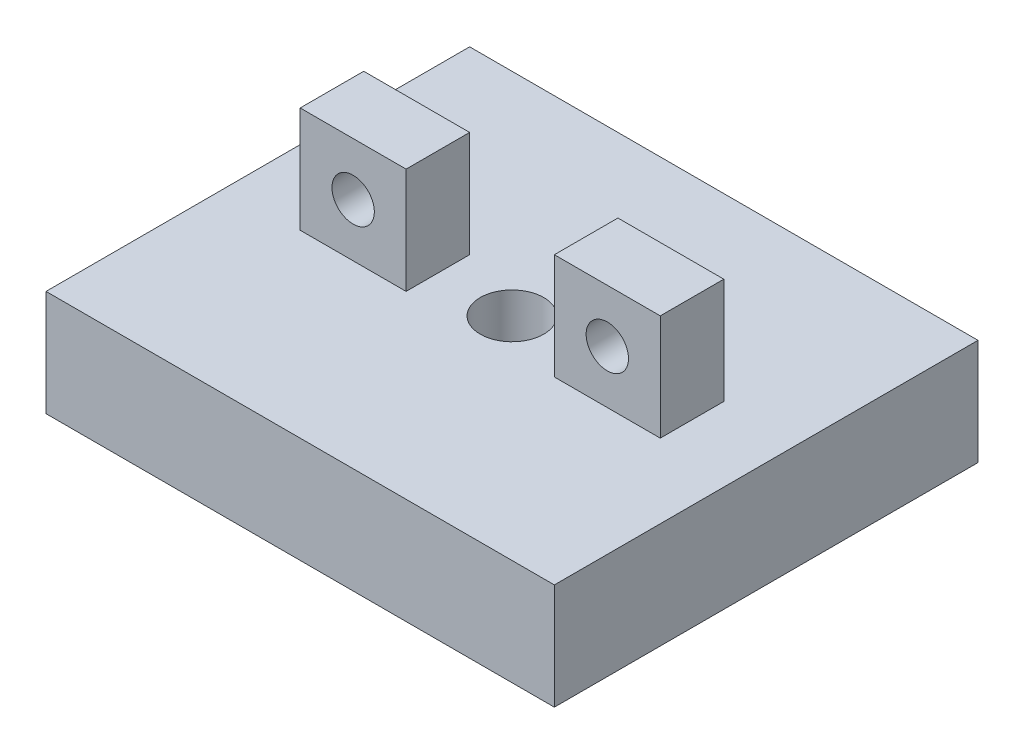
ISO-10303-21;
HEADER;
FILE_DESCRIPTION(('STEP AP214'),'2;1');
FILE_NAME('part.step','',(''),(''),'','','');
FILE_SCHEMA(('AUTOMOTIVE_DESIGN { 1 0 10303 214 1 1 1 1 }'));
ENDSEC;
DATA;
#1=APPLICATION_CONTEXT('core data for automotive mechanical design processes');
#2=APPLICATION_PROTOCOL_DEFINITION('international standard','automotive_design',2000,#1);
#3=PRODUCT_CONTEXT('',#1,'mechanical');
#4=PRODUCT('Part','Part','',(#3));
#5=PRODUCT_RELATED_PRODUCT_CATEGORY('part','',(#4));
#6=PRODUCT_DEFINITION_FORMATION('','',#4);
#7=PRODUCT_DEFINITION_CONTEXT('part definition',#1,'design');
#8=PRODUCT_DEFINITION('design','',#6,#7);
#9=PRODUCT_DEFINITION_SHAPE('','',#8);
#10=(LENGTH_UNIT() NAMED_UNIT(*) SI_UNIT(.MILLI.,.METRE.));
#11=(NAMED_UNIT(*) PLANE_ANGLE_UNIT() SI_UNIT($,.RADIAN.));
#12=(NAMED_UNIT(*) SI_UNIT($,.STERADIAN.) SOLID_ANGLE_UNIT());
#13=UNCERTAINTY_MEASURE_WITH_UNIT(LENGTH_MEASURE(1.E-05),#10,'distance_accuracy_value','');
#14=(GEOMETRIC_REPRESENTATION_CONTEXT(3) GLOBAL_UNCERTAINTY_ASSIGNED_CONTEXT((#13)) GLOBAL_UNIT_ASSIGNED_CONTEXT((#10,
#11,#12)) REPRESENTATION_CONTEXT('',''));
#15=CARTESIAN_POINT('',(0.,0.,0.));
#16=DIRECTION('',(0.,0.,1.));
#17=DIRECTION('',(1.,0.,0.));
#18=AXIS2_PLACEMENT_3D('',#15,#16,#17);
#19=CARTESIAN_POINT('',(-30.7716518723192,5.,-8.56649632267039));
#20=DIRECTION('',(1.,0.,0.));
#21=DIRECTION('',(0.,0.,-1.));
#22=AXIS2_PLACEMENT_3D('',#19,#20,#21);
#23=PLANE('',#22);
#24=DIRECTION('',(0.,0.,1.));
#25=VECTOR('',#24,1.);
#26=CARTESIAN_POINT('',(-30.7716518723192,0.,-8.56649632267039));
#27=LINE('',#26,#25);
#28=CARTESIAN_POINT('',(-30.7716518723192,0.,-8.56649632267039));
#29=VERTEX_POINT('',#28);
#30=CARTESIAN_POINT('',(-30.7716518723192,0.,11.4335036773296));
#31=VERTEX_POINT('',#30);
#32=EDGE_CURVE('E177',#29,#31,#27,.T.);
#33=ORIENTED_EDGE('',*,*,#32,.T.);
#34=DIRECTION('',(0.,-1.,0.));
#35=VECTOR('',#34,1.);
#36=CARTESIAN_POINT('',(-30.7716518723192,5.,11.4335036773296));
#37=LINE('',#36,#35);
#38=CARTESIAN_POINT('',(-30.7716518723192,5.,11.4335036773296));
#39=VERTEX_POINT('',#38);
#40=EDGE_CURVE('E11',#39,#31,#37,.T.);
#41=ORIENTED_EDGE('',*,*,#40,.F.);
#42=DIRECTION('',(0.,0.,1.));
#43=VECTOR('',#42,1.);
#44=CARTESIAN_POINT('',(-30.7716518723192,5.,-8.56649632267039));
#45=LINE('',#44,#43);
#46=CARTESIAN_POINT('',(-30.7716518723192,5.,-8.56649632267039));
#47=VERTEX_POINT('',#46);
#48=EDGE_CURVE('E186',#47,#39,#45,.T.);
#49=ORIENTED_EDGE('',*,*,#48,.F.);
#50=DIRECTION('',(0.,-1.,0.));
#51=VECTOR('',#50,1.);
#52=CARTESIAN_POINT('',(-30.7716518723192,5.,-8.56649632267039));
#53=LINE('',#52,#51);
#54=EDGE_CURVE('E196',#47,#29,#53,.T.);
#55=ORIENTED_EDGE('',*,*,#54,.T.);
#56=EDGE_LOOP('',(#33,#41,#49,#55));
#57=FACE_BOUND('',#56,.T.);
#58=ADVANCED_FACE('F37',(#57),#23,.F.);
#59=CARTESIAN_POINT('',(-30.7716518723192,5.,11.4335036773296));
#60=DIRECTION('',(0.,0.,-1.));
#61=DIRECTION('',(-1.,0.,0.));
#62=AXIS2_PLACEMENT_3D('',#59,#60,#61);
#63=PLANE('',#62);
#64=DIRECTION('',(1.,0.,0.));
#65=VECTOR('',#64,1.);
#66=CARTESIAN_POINT('',(-30.7716518723192,0.,11.4335036773296));
#67=LINE('',#66,#65);
#68=CARTESIAN_POINT('',(-6.77165187231917,0.,11.4335036773296));
#69=VERTEX_POINT('',#68);
#70=EDGE_CURVE('E199',#31,#69,#67,.T.);
#71=ORIENTED_EDGE('',*,*,#70,.T.);
#72=DIRECTION('',(0.,-1.,0.));
#73=VECTOR('',#72,1.);
#74=CARTESIAN_POINT('',(-6.77165187231917,5.,11.4335036773296));
#75=LINE('',#74,#73);
#76=CARTESIAN_POINT('',(-6.77165187231917,5.,11.4335036773296));
#77=VERTEX_POINT('',#76);
#78=EDGE_CURVE('E44',#77,#69,#75,.T.);
#79=ORIENTED_EDGE('',*,*,#78,.F.);
#80=DIRECTION('',(1.,0.,0.));
#81=VECTOR('',#80,1.);
#82=CARTESIAN_POINT('',(-30.7716518723192,5.,11.4335036773296));
#83=LINE('',#82,#81);
#84=EDGE_CURVE('E189',#39,#77,#83,.T.);
#85=ORIENTED_EDGE('',*,*,#84,.F.);
#86=ORIENTED_EDGE('',*,*,#40,.T.);
#87=EDGE_LOOP('',(#71,#79,#85,#86));
#88=FACE_BOUND('',#87,.T.);
#89=ADVANCED_FACE('F228',(#88),#63,.F.);
#90=CARTESIAN_POINT('',(-6.77165187231918,5.,-8.56649632267039));
#91=DIRECTION('',(-1.,0.,0.));
#92=DIRECTION('',(0.,0.,1.));
#93=AXIS2_PLACEMENT_3D('',#90,#91,#92);
#94=PLANE('',#93);
#95=DIRECTION('',(0.,0.,-1.));
#96=VECTOR('',#95,1.);
#97=CARTESIAN_POINT('',(-6.77165187231918,0.,-8.56649632267039));
#98=LINE('',#97,#96);
#99=CARTESIAN_POINT('',(-6.77165187231918,0.,-8.56649632267039));
#100=VERTEX_POINT('',#99);
#101=EDGE_CURVE('E201',#69,#100,#98,.T.);
#102=ORIENTED_EDGE('',*,*,#101,.T.);
#103=DIRECTION('',(0.,-1.,0.));
#104=VECTOR('',#103,1.);
#105=CARTESIAN_POINT('',(-6.77165187231918,5.,-8.56649632267039));
#106=LINE('',#105,#104);
#107=CARTESIAN_POINT('',(-6.77165187231918,5.,-8.56649632267039));
#108=VERTEX_POINT('',#107);
#109=EDGE_CURVE('E206',#108,#100,#106,.T.);
#110=ORIENTED_EDGE('',*,*,#109,.F.);
#111=DIRECTION('',(0.,0.,-1.));
#112=VECTOR('',#111,1.);
#113=CARTESIAN_POINT('',(-6.77165187231918,5.,-8.56649632267039));
#114=LINE('',#113,#112);
#115=EDGE_CURVE('E192',#77,#108,#114,.T.);
#116=ORIENTED_EDGE('',*,*,#115,.F.);
#117=ORIENTED_EDGE('',*,*,#78,.T.);
#118=EDGE_LOOP('',(#102,#110,#116,#117));
#119=FACE_BOUND('',#118,.T.);
#120=ADVANCED_FACE('F213',(#119),#94,.F.);
#121=CARTESIAN_POINT('',(-30.7716518723192,5.,-8.56649632267039));
#122=DIRECTION('',(0.,0.,1.));
#123=DIRECTION('',(1.,0.,0.));
#124=AXIS2_PLACEMENT_3D('',#121,#122,#123);
#125=PLANE('',#124);
#126=DIRECTION('',(-1.,0.,0.));
#127=VECTOR('',#126,1.);
#128=CARTESIAN_POINT('',(-30.7716518723192,0.,-8.56649632267039));
#129=LINE('',#128,#127);
#130=EDGE_CURVE('E190',#100,#29,#129,.T.);
#131=ORIENTED_EDGE('',*,*,#130,.T.);
#132=ORIENTED_EDGE('',*,*,#54,.F.);
#133=DIRECTION('',(-1.,0.,0.));
#134=VECTOR('',#133,1.);
#135=CARTESIAN_POINT('',(-30.7716518723192,5.,-8.56649632267039));
#136=LINE('',#135,#134);
#137=EDGE_CURVE('E194',#108,#47,#136,.T.);
#138=ORIENTED_EDGE('',*,*,#137,.F.);
#139=ORIENTED_EDGE('',*,*,#109,.T.);
#140=EDGE_LOOP('',(#131,#132,#138,#139));
#141=FACE_BOUND('',#140,.T.);
#142=ADVANCED_FACE('F222',(#141),#125,.F.);
#143=CARTESIAN_POINT('',(0.,5.,0.));
#144=DIRECTION('',(0.,1.,0.));
#145=DIRECTION('',(0.,0.,1.));
#146=AXIS2_PLACEMENT_3D('',#143,#144,#145);
#147=PLANE('',#146);
#148=CARTESIAN_POINT('',(-18.7716518723192,5.,1.43350367732961));
#149=DIRECTION('',(0.,1.,0.));
#150=DIRECTION('',(0.,0.,1.));
#151=AXIS2_PLACEMENT_3D('',#148,#149,#150);
#152=CIRCLE('',#151,1.5);
#153=CARTESIAN_POINT('',(-18.7716518723192,5.,2.93350367732961));
#154=VERTEX_POINT('',#153);
#155=EDGE_CURVE('E300',#154,#154,#152,.T.);
#156=ORIENTED_EDGE('',*,*,#155,.F.);
#157=EDGE_LOOP('',(#156));
#158=FACE_BOUND('',#157,.T.);
#159=DIRECTION('',(0.,0.,1.));
#160=VECTOR('',#159,1.);
#161=CARTESIAN_POINT('',(-10.2716518723192,5.,-0.066496322670397));
#162=LINE('',#161,#160);
#163=CARTESIAN_POINT('',(-10.2716518723192,5.,-0.066496322670397));
#164=VERTEX_POINT('',#163);
#165=CARTESIAN_POINT('',(-10.2716518723192,5.,2.9335036773296));
#166=VERTEX_POINT('',#165);
#167=EDGE_CURVE('E121',#164,#166,#162,.T.);
#168=ORIENTED_EDGE('',*,*,#167,.T.);
#169=DIRECTION('',(-1.,0.,0.));
#170=VECTOR('',#169,1.);
#171=CARTESIAN_POINT('',(-10.2716518723192,5.,2.9335036773296));
#172=LINE('',#171,#170);
#173=CARTESIAN_POINT('',(-15.2716518723192,5.,2.9335036773296));
#174=VERTEX_POINT('',#173);
#175=EDGE_CURVE('E126',#166,#174,#172,.T.);
#176=ORIENTED_EDGE('',*,*,#175,.T.);
#177=DIRECTION('',(0.,0.,1.));
#178=VECTOR('',#177,1.);
#179=CARTESIAN_POINT('',(-15.2716518723192,5.,-0.066496322670397));
#180=LINE('',#179,#178);
#181=CARTESIAN_POINT('',(-15.2716518723192,5.,-0.066496322670397));
#182=VERTEX_POINT('',#181);
#183=EDGE_CURVE('E56',#182,#174,#180,.T.);
#184=ORIENTED_EDGE('',*,*,#183,.F.);
#185=DIRECTION('',(-1.,0.,0.));
#186=VECTOR('',#185,1.);
#187=CARTESIAN_POINT('',(-10.2716518723192,5.,-0.066496322670397));
#188=LINE('',#187,#186);
#189=EDGE_CURVE('E51',#164,#182,#188,.T.);
#190=ORIENTED_EDGE('',*,*,#189,.F.);
#191=EDGE_LOOP('',(#168,#176,#184,#190));
#192=FACE_BOUND('',#191,.T.);
#193=DIRECTION('',(1.,0.,0.));
#194=VECTOR('',#193,1.);
#195=CARTESIAN_POINT('',(-27.2716518723192,5.,-0.0664963226703935));
#196=LINE('',#195,#194);
#197=CARTESIAN_POINT('',(-27.2716518723192,5.,-0.0664963226703935));
#198=VERTEX_POINT('',#197);
#199=CARTESIAN_POINT('',(-22.2716518723192,5.,-0.0664963226703935));
#200=VERTEX_POINT('',#199);
#201=EDGE_CURVE('E129',#198,#200,#196,.T.);
#202=ORIENTED_EDGE('',*,*,#201,.T.);
#203=DIRECTION('',(0.,0.,1.));
#204=VECTOR('',#203,1.);
#205=CARTESIAN_POINT('',(-22.2716518723192,5.,-0.0664963226703935));
#206=LINE('',#205,#204);
#207=CARTESIAN_POINT('',(-22.2716518723192,5.,2.93350367732961));
#208=VERTEX_POINT('',#207);
#209=EDGE_CURVE('E167',#200,#208,#206,.T.);
#210=ORIENTED_EDGE('',*,*,#209,.T.);
#211=DIRECTION('',(1.,0.,0.));
#212=VECTOR('',#211,1.);
#213=CARTESIAN_POINT('',(-27.2716518723192,5.,2.93350367732961));
#214=LINE('',#213,#212);
#215=CARTESIAN_POINT('',(-27.2716518723192,5.,2.93350367732961));
#216=VERTEX_POINT('',#215);
#217=EDGE_CURVE('E169',#216,#208,#214,.T.);
#218=ORIENTED_EDGE('',*,*,#217,.F.);
#219=DIRECTION('',(0.,0.,1.));
#220=VECTOR('',#219,1.);
#221=CARTESIAN_POINT('',(-27.2716518723192,5.,-0.0664963226703935));
#222=LINE('',#221,#220);
#223=EDGE_CURVE('E158',#198,#216,#222,.T.);
#224=ORIENTED_EDGE('',*,*,#223,.F.);
#225=EDGE_LOOP('',(#202,#210,#218,#224));
#226=FACE_BOUND('',#225,.T.);
#227=ORIENTED_EDGE('',*,*,#48,.T.);
#228=ORIENTED_EDGE('',*,*,#84,.T.);
#229=ORIENTED_EDGE('',*,*,#115,.T.);
#230=ORIENTED_EDGE('',*,*,#137,.T.);
#231=EDGE_LOOP('',(#227,#228,#229,#230));
#232=FACE_BOUND('',#231,.T.);
#233=ADVANCED_FACE('F123',(#158,#192,#226,#232),#147,.T.);
#234=CARTESIAN_POINT('',(0.,0.,0.));
#235=DIRECTION('',(0.,1.,0.));
#236=DIRECTION('',(0.,0.,1.));
#237=AXIS2_PLACEMENT_3D('',#234,#235,#236);
#238=PLANE('',#237);
#239=CARTESIAN_POINT('',(-18.7716518723192,0.,1.43350367732961));
#240=DIRECTION('',(0.,1.,0.));
#241=DIRECTION('',(0.,0.,1.));
#242=AXIS2_PLACEMENT_3D('',#239,#240,#241);
#243=CIRCLE('',#242,1.5);
#244=CARTESIAN_POINT('',(-18.7716518723192,0.,2.93350367732961));
#245=VERTEX_POINT('',#244);
#246=EDGE_CURVE('E297',#245,#245,#243,.T.);
#247=ORIENTED_EDGE('',*,*,#246,.T.);
#248=EDGE_LOOP('',(#247));
#249=FACE_BOUND('',#248,.T.);
#250=ORIENTED_EDGE('',*,*,#32,.F.);
#251=ORIENTED_EDGE('',*,*,#130,.F.);
#252=ORIENTED_EDGE('',*,*,#101,.F.);
#253=ORIENTED_EDGE('',*,*,#70,.F.);
#254=EDGE_LOOP('',(#250,#251,#252,#253));
#255=FACE_BOUND('',#254,.T.);
#256=ADVANCED_FACE('F219',(#249,#255),#238,.F.);
#257=CARTESIAN_POINT('',(-27.2716518723192,10.,-0.0664963226703935));
#258=DIRECTION('',(0.,0.,-1.));
#259=DIRECTION('',(-1.,0.,0.));
#260=AXIS2_PLACEMENT_3D('',#257,#258,#259);
#261=PLANE('',#260);
#262=CARTESIAN_POINT('',(-24.7716518723192,7.5,-0.0664963226703935));
#263=DIRECTION('',(0.,0.,-1.));
#264=DIRECTION('',(-1.,0.,0.));
#265=AXIS2_PLACEMENT_3D('',#262,#263,#264);
#266=CIRCLE('',#265,1.);
#267=CARTESIAN_POINT('',(-25.7716518723192,7.5,-0.0664963226703935));
#268=VERTEX_POINT('',#267);
#269=EDGE_CURVE('E302',#268,#268,#266,.T.);
#270=ORIENTED_EDGE('',*,*,#269,.F.);
#271=EDGE_LOOP('',(#270));
#272=FACE_BOUND('',#271,.T.);
#273=ORIENTED_EDGE('',*,*,#201,.F.);
#274=DIRECTION('',(0.,-1.,0.));
#275=VECTOR('',#274,1.);
#276=CARTESIAN_POINT('',(-27.2716518723192,10.,-0.0664963226703935));
#277=LINE('',#276,#275);
#278=CARTESIAN_POINT('',(-27.2716518723192,10.,-0.0664963226703935));
#279=VERTEX_POINT('',#278);
#280=EDGE_CURVE('E174',#279,#198,#277,.T.);
#281=ORIENTED_EDGE('',*,*,#280,.F.);
#282=DIRECTION('',(1.,0.,0.));
#283=VECTOR('',#282,1.);
#284=CARTESIAN_POINT('',(-27.2716518723192,10.,-0.0664963226703935));
#285=LINE('',#284,#283);
#286=CARTESIAN_POINT('',(-22.2716518723192,10.,-0.0664963226703935));
#287=VERTEX_POINT('',#286);
#288=EDGE_CURVE('E154',#279,#287,#285,.T.);
#289=ORIENTED_EDGE('',*,*,#288,.T.);
#290=DIRECTION('',(0.,-1.,0.));
#291=VECTOR('',#290,1.);
#292=CARTESIAN_POINT('',(-22.2716518723192,10.,-0.0664963226703935));
#293=LINE('',#292,#291);
#294=EDGE_CURVE('E165',#287,#200,#293,.T.);
#295=ORIENTED_EDGE('',*,*,#294,.T.);
#296=EDGE_LOOP('',(#273,#281,#289,#295));
#297=FACE_BOUND('',#296,.T.);
#298=ADVANCED_FACE('F240',(#272,#297),#261,.T.);
#299=CARTESIAN_POINT('',(-27.2716518723192,10.,-0.0664963226703935));
#300=DIRECTION('',(1.,0.,0.));
#301=DIRECTION('',(0.,0.,-1.));
#302=AXIS2_PLACEMENT_3D('',#299,#300,#301);
#303=PLANE('',#302);
#304=ORIENTED_EDGE('',*,*,#223,.T.);
#305=DIRECTION('',(0.,-1.,0.));
#306=VECTOR('',#305,1.);
#307=CARTESIAN_POINT('',(-27.2716518723192,10.,2.93350367732961));
#308=LINE('',#307,#306);
#309=CARTESIAN_POINT('',(-27.2716518723192,10.,2.93350367732961));
#310=VERTEX_POINT('',#309);
#311=EDGE_CURVE('E178',#310,#216,#308,.T.);
#312=ORIENTED_EDGE('',*,*,#311,.F.);
#313=DIRECTION('',(0.,0.,1.));
#314=VECTOR('',#313,1.);
#315=CARTESIAN_POINT('',(-27.2716518723192,10.,-0.0664963226703935));
#316=LINE('',#315,#314);
#317=EDGE_CURVE('E163',#279,#310,#316,.T.);
#318=ORIENTED_EDGE('',*,*,#317,.F.);
#319=ORIENTED_EDGE('',*,*,#280,.T.);
#320=EDGE_LOOP('',(#304,#312,#318,#319));
#321=FACE_BOUND('',#320,.T.);
#322=ADVANCED_FACE('F247',(#321),#303,.F.);
#323=CARTESIAN_POINT('',(-27.2716518723192,10.,2.93350367732961));
#324=DIRECTION('',(0.,0.,-1.));
#325=DIRECTION('',(-1.,0.,0.));
#326=AXIS2_PLACEMENT_3D('',#323,#324,#325);
#327=PLANE('',#326);
#328=CARTESIAN_POINT('',(-24.7716518723192,7.5,2.93350367732961));
#329=DIRECTION('',(0.,0.,-1.));
#330=DIRECTION('',(-1.,0.,0.));
#331=AXIS2_PLACEMENT_3D('',#328,#329,#330);
#332=CIRCLE('',#331,1.);
#333=CARTESIAN_POINT('',(-25.7716518723192,7.5,2.93350367732961));
#334=VERTEX_POINT('',#333);
#335=EDGE_CURVE('E305',#334,#334,#332,.T.);
#336=ORIENTED_EDGE('',*,*,#335,.T.);
#337=EDGE_LOOP('',(#336));
#338=FACE_BOUND('',#337,.T.);
#339=ORIENTED_EDGE('',*,*,#217,.T.);
#340=DIRECTION('',(0.,-1.,0.));
#341=VECTOR('',#340,1.);
#342=CARTESIAN_POINT('',(-22.2716518723192,10.,2.93350367732961));
#343=LINE('',#342,#341);
#344=CARTESIAN_POINT('',(-22.2716518723192,10.,2.93350367732961));
#345=VERTEX_POINT('',#344);
#346=EDGE_CURVE('E181',#345,#208,#343,.T.);
#347=ORIENTED_EDGE('',*,*,#346,.F.);
#348=DIRECTION('',(1.,0.,0.));
#349=VECTOR('',#348,1.);
#350=CARTESIAN_POINT('',(-27.2716518723192,10.,2.93350367732961));
#351=LINE('',#350,#349);
#352=EDGE_CURVE('E161',#310,#345,#351,.T.);
#353=ORIENTED_EDGE('',*,*,#352,.F.);
#354=ORIENTED_EDGE('',*,*,#311,.T.);
#355=EDGE_LOOP('',(#339,#347,#353,#354));
#356=FACE_BOUND('',#355,.T.);
#357=ADVANCED_FACE('F253',(#338,#356),#327,.F.);
#358=CARTESIAN_POINT('',(-22.2716518723192,10.,-0.0664963226703935));
#359=DIRECTION('',(1.,0.,0.));
#360=DIRECTION('',(0.,0.,-1.));
#361=AXIS2_PLACEMENT_3D('',#358,#359,#360);
#362=PLANE('',#361);
#363=ORIENTED_EDGE('',*,*,#209,.F.);
#364=ORIENTED_EDGE('',*,*,#294,.F.);
#365=DIRECTION('',(0.,0.,1.));
#366=VECTOR('',#365,1.);
#367=CARTESIAN_POINT('',(-22.2716518723192,10.,-0.0664963226703935));
#368=LINE('',#367,#366);
#369=EDGE_CURVE('E157',#287,#345,#368,.T.);
#370=ORIENTED_EDGE('',*,*,#369,.T.);
#371=ORIENTED_EDGE('',*,*,#346,.T.);
#372=EDGE_LOOP('',(#363,#364,#370,#371));
#373=FACE_BOUND('',#372,.T.);
#374=ADVANCED_FACE('F249',(#373),#362,.T.);
#375=CARTESIAN_POINT('',(0.,10.,0.));
#376=DIRECTION('',(0.,-1.,0.));
#377=DIRECTION('',(0.,0.,-1.));
#378=AXIS2_PLACEMENT_3D('',#375,#376,#377);
#379=PLANE('',#378);
#380=ORIENTED_EDGE('',*,*,#288,.F.);
#381=ORIENTED_EDGE('',*,*,#317,.T.);
#382=ORIENTED_EDGE('',*,*,#352,.T.);
#383=ORIENTED_EDGE('',*,*,#369,.F.);
#384=EDGE_LOOP('',(#380,#381,#382,#383));
#385=FACE_BOUND('',#384,.T.);
#386=ADVANCED_FACE('F252',(#385),#379,.F.);
#387=CARTESIAN_POINT('',(-10.2716518723192,10.,-0.066496322670397));
#388=DIRECTION('',(1.,0.,0.));
#389=DIRECTION('',(0.,0.,-1.));
#390=AXIS2_PLACEMENT_3D('',#387,#388,#389);
#391=PLANE('',#390);
#392=ORIENTED_EDGE('',*,*,#167,.F.);
#393=DIRECTION('',(0.,-1.,0.));
#394=VECTOR('',#393,1.);
#395=CARTESIAN_POINT('',(-10.2716518723192,10.,-0.066496322670397));
#396=LINE('',#395,#394);
#397=CARTESIAN_POINT('',(-10.2716518723192,10.,-0.066496322670397));
#398=VERTEX_POINT('',#397);
#399=EDGE_CURVE('E314',#398,#164,#396,.T.);
#400=ORIENTED_EDGE('',*,*,#399,.F.);
#401=DIRECTION('',(0.,0.,1.));
#402=VECTOR('',#401,1.);
#403=CARTESIAN_POINT('',(-10.2716518723192,10.,-0.066496322670397));
#404=LINE('',#403,#402);
#405=CARTESIAN_POINT('',(-10.2716518723192,10.,2.9335036773296));
#406=VERTEX_POINT('',#405);
#407=EDGE_CURVE('E135',#398,#406,#404,.T.);
#408=ORIENTED_EDGE('',*,*,#407,.T.);
#409=DIRECTION('',(0.,-1.,0.));
#410=VECTOR('',#409,1.);
#411=CARTESIAN_POINT('',(-10.2716518723192,10.,2.9335036773296));
#412=LINE('',#411,#410);
#413=EDGE_CURVE('E132',#406,#166,#412,.T.);
#414=ORIENTED_EDGE('',*,*,#413,.T.);
#415=EDGE_LOOP('',(#392,#400,#408,#414));
#416=FACE_BOUND('',#415,.T.);
#417=ADVANCED_FACE('F133',(#416),#391,.T.);
#418=CARTESIAN_POINT('',(-10.2716518723192,10.,-0.066496322670397));
#419=DIRECTION('',(0.,0.,1.));
#420=DIRECTION('',(1.,0.,0.));
#421=AXIS2_PLACEMENT_3D('',#418,#419,#420);
#422=PLANE('',#421);
#423=CARTESIAN_POINT('',(-12.7716518723192,7.5,-0.066496322670397));
#424=DIRECTION('',(0.,0.,-1.));
#425=DIRECTION('',(-1.,0.,0.));
#426=AXIS2_PLACEMENT_3D('',#423,#424,#425);
#427=CIRCLE('',#426,1.);
#428=CARTESIAN_POINT('',(-13.7716518723192,7.5,-0.066496322670397));
#429=VERTEX_POINT('',#428);
#430=EDGE_CURVE('E308',#429,#429,#427,.T.);
#431=ORIENTED_EDGE('',*,*,#430,.F.);
#432=EDGE_LOOP('',(#431));
#433=FACE_BOUND('',#432,.T.);
#434=ORIENTED_EDGE('',*,*,#189,.T.);
#435=DIRECTION('',(0.,-1.,0.));
#436=VECTOR('',#435,1.);
#437=CARTESIAN_POINT('',(-15.2716518723192,10.,-0.066496322670397));
#438=LINE('',#437,#436);
#439=CARTESIAN_POINT('',(-15.2716518723192,10.,-0.066496322670397));
#440=VERTEX_POINT('',#439);
#441=EDGE_CURVE('E318',#440,#182,#438,.T.);
#442=ORIENTED_EDGE('',*,*,#441,.F.);
#443=DIRECTION('',(-1.,0.,0.));
#444=VECTOR('',#443,1.);
#445=CARTESIAN_POINT('',(-10.2716518723192,10.,-0.066496322670397));
#446=LINE('',#445,#444);
#447=EDGE_CURVE('E139',#398,#440,#446,.T.);
#448=ORIENTED_EDGE('',*,*,#447,.F.);
#449=ORIENTED_EDGE('',*,*,#399,.T.);
#450=EDGE_LOOP('',(#434,#442,#448,#449));
#451=FACE_BOUND('',#450,.T.);
#452=ADVANCED_FACE('F269',(#433,#451),#422,.F.);
#453=CARTESIAN_POINT('',(-15.2716518723192,10.,-0.066496322670397));
#454=DIRECTION('',(1.,0.,0.));
#455=DIRECTION('',(0.,0.,-1.));
#456=AXIS2_PLACEMENT_3D('',#453,#454,#455);
#457=PLANE('',#456);
#458=ORIENTED_EDGE('',*,*,#183,.T.);
#459=DIRECTION('',(0.,-1.,0.));
#460=VECTOR('',#459,1.);
#461=CARTESIAN_POINT('',(-15.2716518723192,10.,2.9335036773296));
#462=LINE('',#461,#460);
#463=CARTESIAN_POINT('',(-15.2716518723192,10.,2.9335036773296));
#464=VERTEX_POINT('',#463);
#465=EDGE_CURVE('E140',#464,#174,#462,.T.);
#466=ORIENTED_EDGE('',*,*,#465,.F.);
#467=DIRECTION('',(0.,0.,1.));
#468=VECTOR('',#467,1.);
#469=CARTESIAN_POINT('',(-15.2716518723192,10.,-0.066496322670397));
#470=LINE('',#469,#468);
#471=EDGE_CURVE('E149',#440,#464,#470,.T.);
#472=ORIENTED_EDGE('',*,*,#471,.F.);
#473=ORIENTED_EDGE('',*,*,#441,.T.);
#474=EDGE_LOOP('',(#458,#466,#472,#473));
#475=FACE_BOUND('',#474,.T.);
#476=ADVANCED_FACE('F272',(#475),#457,.F.);
#477=CARTESIAN_POINT('',(-10.2716518723192,10.,2.9335036773296));
#478=DIRECTION('',(0.,0.,1.));
#479=DIRECTION('',(1.,0.,0.));
#480=AXIS2_PLACEMENT_3D('',#477,#478,#479);
#481=PLANE('',#480);
#482=CARTESIAN_POINT('',(-12.7716518723192,7.5,2.9335036773296));
#483=DIRECTION('',(0.,0.,-1.));
#484=DIRECTION('',(-1.,0.,0.));
#485=AXIS2_PLACEMENT_3D('',#482,#483,#484);
#486=CIRCLE('',#485,1.);
#487=CARTESIAN_POINT('',(-13.7716518723192,7.5,2.9335036773296));
#488=VERTEX_POINT('',#487);
#489=EDGE_CURVE('E311',#488,#488,#486,.T.);
#490=ORIENTED_EDGE('',*,*,#489,.T.);
#491=EDGE_LOOP('',(#490));
#492=FACE_BOUND('',#491,.T.);
#493=ORIENTED_EDGE('',*,*,#175,.F.);
#494=ORIENTED_EDGE('',*,*,#413,.F.);
#495=DIRECTION('',(-1.,0.,0.));
#496=VECTOR('',#495,1.);
#497=CARTESIAN_POINT('',(-10.2716518723192,10.,2.9335036773296));
#498=LINE('',#497,#496);
#499=EDGE_CURVE('E151',#406,#464,#498,.T.);
#500=ORIENTED_EDGE('',*,*,#499,.T.);
#501=ORIENTED_EDGE('',*,*,#465,.T.);
#502=EDGE_LOOP('',(#493,#494,#500,#501));
#503=FACE_BOUND('',#502,.T.);
#504=ADVANCED_FACE('F142',(#492,#503),#481,.T.);
#505=CARTESIAN_POINT('',(0.,10.,0.));
#506=DIRECTION('',(0.,-1.,0.));
#507=DIRECTION('',(0.,0.,-1.));
#508=AXIS2_PLACEMENT_3D('',#505,#506,#507);
#509=PLANE('',#508);
#510=ORIENTED_EDGE('',*,*,#407,.F.);
#511=ORIENTED_EDGE('',*,*,#447,.T.);
#512=ORIENTED_EDGE('',*,*,#471,.T.);
#513=ORIENTED_EDGE('',*,*,#499,.F.);
#514=EDGE_LOOP('',(#510,#511,#512,#513));
#515=FACE_BOUND('',#514,.T.);
#516=ADVANCED_FACE('F264',(#515),#509,.F.);
#517=CARTESIAN_POINT('',(-12.7716518723192,7.5,2.9335036773296));
#518=DIRECTION('',(0.,0.,-1.));
#519=DIRECTION('',(-1.,0.,0.));
#520=AXIS2_PLACEMENT_3D('',#517,#518,#519);
#521=CYLINDRICAL_SURFACE('',#520,1.);
#522=ORIENTED_EDGE('',*,*,#489,.F.);
#523=EDGE_LOOP('',(#522));
#524=FACE_BOUND('',#523,.T.);
#525=ORIENTED_EDGE('',*,*,#430,.T.);
#526=EDGE_LOOP('',(#525));
#527=FACE_BOUND('',#526,.T.);
#528=ADVANCED_FACE('F267',(#524,#527),#521,.F.);
#529=CARTESIAN_POINT('',(-24.7716518723192,7.5,2.93350367732961));
#530=DIRECTION('',(0.,0.,-1.));
#531=DIRECTION('',(-1.,0.,0.));
#532=AXIS2_PLACEMENT_3D('',#529,#530,#531);
#533=CYLINDRICAL_SURFACE('',#532,1.);
#534=ORIENTED_EDGE('',*,*,#335,.F.);
#535=EDGE_LOOP('',(#534));
#536=FACE_BOUND('',#535,.T.);
#537=ORIENTED_EDGE('',*,*,#269,.T.);
#538=EDGE_LOOP('',(#537));
#539=FACE_BOUND('',#538,.T.);
#540=ADVANCED_FACE('F284',(#536,#539),#533,.F.);
#541=CARTESIAN_POINT('',(-18.7716518723192,0.,1.43350367732961));
#542=DIRECTION('',(0.,1.,0.));
#543=DIRECTION('',(0.,0.,1.));
#544=AXIS2_PLACEMENT_3D('',#541,#542,#543);
#545=CYLINDRICAL_SURFACE('',#544,1.5);
#546=ORIENTED_EDGE('',*,*,#246,.F.);
#547=EDGE_LOOP('',(#546));
#548=FACE_BOUND('',#547,.T.);
#549=ORIENTED_EDGE('',*,*,#155,.T.);
#550=EDGE_LOOP('',(#549));
#551=FACE_BOUND('',#550,.T.);
#552=ADVANCED_FACE('F288',(#548,#551),#545,.F.);
#553=CLOSED_SHELL('',(#58,#89,#120,#142,#233,#256,#298,#322,#357,#374,#386,#417,#452,#476,#504,
#516,#528,#540,#552));
#554=MANIFOLD_SOLID_BREP('B2',#553);
#555=ADVANCED_BREP_SHAPE_REPRESENTATION('',(#18,#554),#14);
#556=SHAPE_DEFINITION_REPRESENTATION(#9,#555);
ENDSEC;
END-ISO-10303-21;
